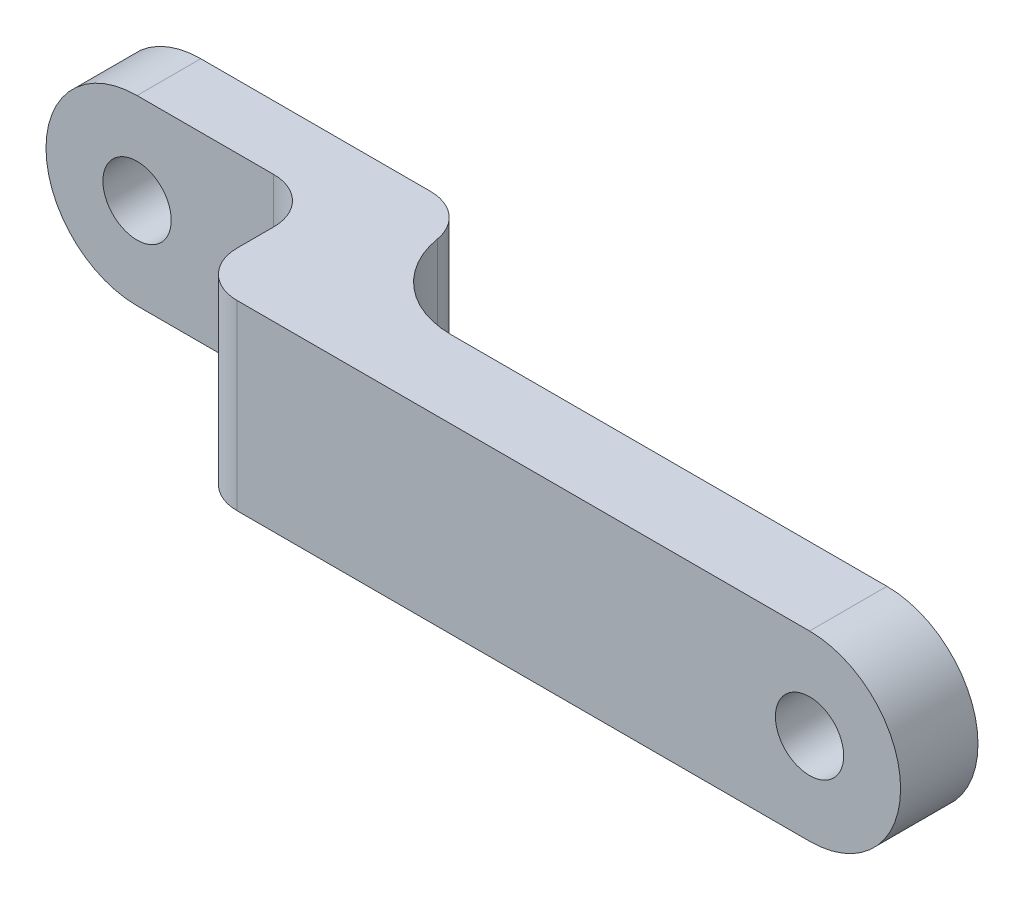
ISO-10303-21;
HEADER;
FILE_DESCRIPTION(('STEP AP214'),'2;1');
FILE_NAME('part.step','',(''),(''),'','','');
FILE_SCHEMA(('AUTOMOTIVE_DESIGN { 1 0 10303 214 1 1 1 1 }'));
ENDSEC;
DATA;
#1=APPLICATION_CONTEXT('core data for automotive mechanical design processes');
#2=APPLICATION_PROTOCOL_DEFINITION('international standard','automotive_design',2000,#1);
#3=PRODUCT_CONTEXT('',#1,'mechanical');
#4=PRODUCT('Part','Part','',(#3));
#5=PRODUCT_RELATED_PRODUCT_CATEGORY('part','',(#4));
#6=PRODUCT_DEFINITION_FORMATION('','',#4);
#7=PRODUCT_DEFINITION_CONTEXT('part definition',#1,'design');
#8=PRODUCT_DEFINITION('design','',#6,#7);
#9=PRODUCT_DEFINITION_SHAPE('','',#8);
#10=(LENGTH_UNIT() NAMED_UNIT(*) SI_UNIT(.MILLI.,.METRE.));
#11=(NAMED_UNIT(*) PLANE_ANGLE_UNIT() SI_UNIT($,.RADIAN.));
#12=(NAMED_UNIT(*) SI_UNIT($,.STERADIAN.) SOLID_ANGLE_UNIT());
#13=UNCERTAINTY_MEASURE_WITH_UNIT(LENGTH_MEASURE(1.E-05),#10,'distance_accuracy_value','');
#14=(GEOMETRIC_REPRESENTATION_CONTEXT(3) GLOBAL_UNCERTAINTY_ASSIGNED_CONTEXT((#13)) GLOBAL_UNIT_ASSIGNED_CONTEXT((#10,
#11,#12)) REPRESENTATION_CONTEXT('',''));
#15=CARTESIAN_POINT('',(0.,0.,0.));
#16=DIRECTION('',(0.,0.,1.));
#17=DIRECTION('',(1.,0.,0.));
#18=AXIS2_PLACEMENT_3D('',#15,#16,#17);
#19=CARTESIAN_POINT('',(0.,0.,0.85));
#20=DIRECTION('',(0.,0.,-1.));
#21=DIRECTION('',(-1.,0.,0.));
#22=AXIS2_PLACEMENT_3D('',#19,#20,#21);
#23=CYLINDRICAL_SURFACE('',#22,2.);
#24=CARTESIAN_POINT('',(0.,0.,-1.95));
#25=DIRECTION('',(0.,0.,1.));
#26=DIRECTION('',(1.,0.,0.));
#27=AXIS2_PLACEMENT_3D('',#24,#25,#26);
#28=CIRCLE('',#27,2.);
#29=CARTESIAN_POINT('',(0.,2.,-1.95));
#30=VERTEX_POINT('',#29);
#31=CARTESIAN_POINT('',(0.,-2.,-1.95));
#32=VERTEX_POINT('',#31);
#33=EDGE_CURVE('E117',#30,#32,#28,.T.);
#34=ORIENTED_EDGE('',*,*,#33,.F.);
#35=DIRECTION('',(0.,0.,-1.));
#36=VECTOR('',#35,1.);
#37=CARTESIAN_POINT('',(0.,2.,0.85));
#38=LINE('',#37,#36);
#39=CARTESIAN_POINT('',(0.,2.,-3.35));
#40=VERTEX_POINT('',#39);
#41=EDGE_CURVE('E250',#30,#40,#38,.T.);
#42=ORIENTED_EDGE('',*,*,#41,.T.);
#43=CARTESIAN_POINT('',(0.,0.,-3.35));
#44=DIRECTION('',(0.,0.,-1.));
#45=DIRECTION('',(-1.,0.,0.));
#46=AXIS2_PLACEMENT_3D('',#43,#44,#45);
#47=CIRCLE('',#46,2.);
#48=CARTESIAN_POINT('',(0.,-2.,-3.35));
#49=VERTEX_POINT('',#48);
#50=EDGE_CURVE('E140',#49,#40,#47,.T.);
#51=ORIENTED_EDGE('',*,*,#50,.F.);
#52=DIRECTION('',(0.,0.,-1.));
#53=VECTOR('',#52,1.);
#54=CARTESIAN_POINT('',(0.,-2.,0.85));
#55=LINE('',#54,#53);
#56=EDGE_CURVE('E134',#32,#49,#55,.T.);
#57=ORIENTED_EDGE('',*,*,#56,.F.);
#58=EDGE_LOOP('',(#34,#42,#51,#57));
#59=FACE_BOUND('',#58,.T.);
#60=ADVANCED_FACE('F34',(#59),#23,.T.);
#61=CARTESIAN_POINT('',(0.,0.,0.85));
#62=DIRECTION('',(0.,0.,-1.));
#63=DIRECTION('',(-1.,0.,0.));
#64=AXIS2_PLACEMENT_3D('',#61,#62,#63);
#65=CYLINDRICAL_SURFACE('',#64,0.75);
#66=CARTESIAN_POINT('',(0.,0.,-3.35));
#67=DIRECTION('',(0.,0.,-1.));
#68=DIRECTION('',(-1.,0.,0.));
#69=AXIS2_PLACEMENT_3D('',#66,#67,#68);
#70=CIRCLE('',#69,0.75);
#71=CARTESIAN_POINT('',(-0.75,0.,-3.35));
#72=VERTEX_POINT('',#71);
#73=EDGE_CURVE('E183',#72,#72,#70,.T.);
#74=ORIENTED_EDGE('',*,*,#73,.T.);
#75=EDGE_LOOP('',(#74));
#76=FACE_BOUND('',#75,.T.);
#77=CARTESIAN_POINT('',(0.,0.,-1.95));
#78=DIRECTION('',(0.,0.,1.));
#79=DIRECTION('',(1.,0.,0.));
#80=AXIS2_PLACEMENT_3D('',#77,#78,#79);
#81=CIRCLE('',#80,0.75);
#82=CARTESIAN_POINT('',(0.75,0.,-1.95));
#83=VERTEX_POINT('',#82);
#84=EDGE_CURVE('E128',#83,#83,#81,.T.);
#85=ORIENTED_EDGE('',*,*,#84,.T.);
#86=EDGE_LOOP('',(#85));
#87=FACE_BOUND('',#86,.T.);
#88=ADVANCED_FACE('F198',(#76,#87),#65,.F.);
#89=CARTESIAN_POINT('',(0.,0.,-0.85));
#90=DIRECTION('',(0.,0.,1.));
#91=DIRECTION('',(1.,0.,0.));
#92=AXIS2_PLACEMENT_3D('',#89,#90,#91);
#93=PLANE('',#92);
#94=CARTESIAN_POINT('',(17.57,0.,-0.85));
#95=DIRECTION('',(0.,0.,1.));
#96=DIRECTION('',(1.,0.,0.));
#97=AXIS2_PLACEMENT_3D('',#94,#95,#96);
#98=CIRCLE('',#97,0.750000000000002);
#99=CARTESIAN_POINT('',(18.32,0.,-0.85));
#100=VERTEX_POINT('',#99);
#101=EDGE_CURVE('E232',#100,#100,#98,.T.);
#102=ORIENTED_EDGE('',*,*,#101,.T.);
#103=EDGE_LOOP('',(#102));
#104=FACE_BOUND('',#103,.T.);
#105=DIRECTION('',(1.,0.,0.));
#106=VECTOR('',#105,1.);
#107=CARTESIAN_POINT('',(0.,-2.,-0.85));
#108=LINE('',#107,#106);
#109=CARTESIAN_POINT('',(8.,-2.,-0.85));
#110=VERTEX_POINT('',#109);
#111=CARTESIAN_POINT('',(17.57,-2.,-0.85));
#112=VERTEX_POINT('',#111);
#113=EDGE_CURVE('E240',#110,#112,#108,.T.);
#114=ORIENTED_EDGE('',*,*,#113,.F.);
#115=DIRECTION('',(0.,-1.,0.));
#116=VECTOR('',#115,1.);
#117=CARTESIAN_POINT('',(8.,2.,-0.85));
#118=LINE('',#117,#116);
#119=CARTESIAN_POINT('',(8.,2.,-0.85));
#120=VERTEX_POINT('',#119);
#121=EDGE_CURVE('E141',#110,#120,#118,.F.);
#122=ORIENTED_EDGE('',*,*,#121,.T.);
#123=DIRECTION('',(-1.,0.,0.));
#124=VECTOR('',#123,1.);
#125=CARTESIAN_POINT('',(0.,2.,-0.85));
#126=LINE('',#125,#124);
#127=CARTESIAN_POINT('',(17.57,2.,-0.85));
#128=VERTEX_POINT('',#127);
#129=EDGE_CURVE('E246',#128,#120,#126,.T.);
#130=ORIENTED_EDGE('',*,*,#129,.F.);
#131=CARTESIAN_POINT('',(17.57,0.,-0.85));
#132=DIRECTION('',(0.,0.,1.));
#133=DIRECTION('',(1.,0.,0.));
#134=AXIS2_PLACEMENT_3D('',#131,#132,#133);
#135=CIRCLE('',#134,2.);
#136=EDGE_CURVE('E252',#112,#128,#135,.T.);
#137=ORIENTED_EDGE('',*,*,#136,.F.);
#138=EDGE_LOOP('',(#114,#122,#130,#137));
#139=FACE_BOUND('',#138,.T.);
#140=ADVANCED_FACE('F203',(#104,#139),#93,.F.);
#141=CARTESIAN_POINT('',(0.,0.,0.85));
#142=DIRECTION('',(0.,0.,1.));
#143=DIRECTION('',(1.,0.,0.));
#144=AXIS2_PLACEMENT_3D('',#141,#142,#143);
#145=PLANE('',#144);
#146=DIRECTION('',(-1.,0.,0.));
#147=VECTOR('',#146,1.);
#148=CARTESIAN_POINT('',(0.,2.,0.85));
#149=LINE('',#148,#147);
#150=CARTESIAN_POINT('',(17.57,2.,0.85));
#151=VERTEX_POINT('',#150);
#152=CARTESIAN_POINT('',(5.,2.,0.85));
#153=VERTEX_POINT('',#152);
#154=EDGE_CURVE('E248',#151,#153,#149,.T.);
#155=ORIENTED_EDGE('',*,*,#154,.T.);
#156=DIRECTION('',(0.,1.,0.));
#157=VECTOR('',#156,1.);
#158=CARTESIAN_POINT('',(5.,-2.,0.85));
#159=LINE('',#158,#157);
#160=CARTESIAN_POINT('',(5.,-2.,0.85));
#161=VERTEX_POINT('',#160);
#162=EDGE_CURVE('E49',#153,#161,#159,.F.);
#163=ORIENTED_EDGE('',*,*,#162,.T.);
#164=DIRECTION('',(1.,0.,0.));
#165=VECTOR('',#164,1.);
#166=CARTESIAN_POINT('',(0.,-2.,0.85));
#167=LINE('',#166,#165);
#168=CARTESIAN_POINT('',(17.57,-2.,0.85));
#169=VERTEX_POINT('',#168);
#170=EDGE_CURVE('E243',#161,#169,#167,.T.);
#171=ORIENTED_EDGE('',*,*,#170,.T.);
#172=CARTESIAN_POINT('',(17.57,0.,0.85));
#173=DIRECTION('',(0.,0.,1.));
#174=DIRECTION('',(1.,0.,0.));
#175=AXIS2_PLACEMENT_3D('',#172,#173,#174);
#176=CIRCLE('',#175,2.);
#177=EDGE_CURVE('E245',#169,#151,#176,.T.);
#178=ORIENTED_EDGE('',*,*,#177,.T.);
#179=EDGE_LOOP('',(#155,#163,#171,#178));
#180=FACE_BOUND('',#179,.T.);
#181=CARTESIAN_POINT('',(17.57,0.,0.85));
#182=DIRECTION('',(0.,0.,1.));
#183=DIRECTION('',(1.,0.,0.));
#184=AXIS2_PLACEMENT_3D('',#181,#182,#183);
#185=CIRCLE('',#184,0.750000000000002);
#186=CARTESIAN_POINT('',(18.32,0.,0.85));
#187=VERTEX_POINT('',#186);
#188=EDGE_CURVE('E237',#187,#187,#185,.T.);
#189=ORIENTED_EDGE('',*,*,#188,.F.);
#190=EDGE_LOOP('',(#189));
#191=FACE_BOUND('',#190,.T.);
#192=ADVANCED_FACE('F264',(#180,#191),#145,.T.);
#193=CARTESIAN_POINT('',(0.,-2.,0.85));
#194=DIRECTION('',(0.,1.,0.));
#195=DIRECTION('',(0.,0.,1.));
#196=AXIS2_PLACEMENT_3D('',#193,#194,#195);
#197=PLANE('',#196);
#198=ORIENTED_EDGE('',*,*,#170,.F.);
#199=CARTESIAN_POINT('',(5.,-2.,-0.15));
#200=DIRECTION('',(0.,1.,0.));
#201=DIRECTION('',(0.,0.,1.));
#202=AXIS2_PLACEMENT_3D('',#199,#200,#201);
#203=CIRCLE('',#202,1.);
#204=CARTESIAN_POINT('',(4.,-2.,-0.15));
#205=VERTEX_POINT('',#204);
#206=EDGE_CURVE('E173',#161,#205,#203,.F.);
#207=ORIENTED_EDGE('',*,*,#206,.T.);
#208=DIRECTION('',(0.,0.,1.));
#209=VECTOR('',#208,1.);
#210=CARTESIAN_POINT('',(4.,-2.,-1.95));
#211=LINE('',#210,#209);
#212=CARTESIAN_POINT('',(4.,-2.,-0.95));
#213=VERTEX_POINT('',#212);
#214=EDGE_CURVE('E184',#213,#205,#211,.T.);
#215=ORIENTED_EDGE('',*,*,#214,.F.);
#216=CARTESIAN_POINT('',(3.,-2.,-0.95));
#217=DIRECTION('',(0.,1.,0.));
#218=DIRECTION('',(0.,0.,1.));
#219=AXIS2_PLACEMENT_3D('',#216,#217,#218);
#220=CIRCLE('',#219,1.);
#221=CARTESIAN_POINT('',(3.,-2.,-1.95));
#222=VERTEX_POINT('',#221);
#223=EDGE_CURVE('E11',#213,#222,#220,.T.);
#224=ORIENTED_EDGE('',*,*,#223,.T.);
#225=DIRECTION('',(1.,0.,0.));
#226=VECTOR('',#225,1.);
#227=CARTESIAN_POINT('',(0.,-2.,-1.95));
#228=LINE('',#227,#226);
#229=EDGE_CURVE('E121',#32,#222,#228,.T.);
#230=ORIENTED_EDGE('',*,*,#229,.F.);
#231=ORIENTED_EDGE('',*,*,#56,.T.);
#232=DIRECTION('',(-1.,0.,0.));
#233=VECTOR('',#232,1.);
#234=CARTESIAN_POINT('',(6.,-2.,-3.35));
#235=LINE('',#234,#233);
#236=CARTESIAN_POINT('',(5.04196010845019,-2.,-3.35));
#237=VERTEX_POINT('',#236);
#238=EDGE_CURVE('E230',#237,#49,#235,.T.);
#239=ORIENTED_EDGE('',*,*,#238,.F.);
#240=CARTESIAN_POINT('',(5.04196010845019,-2.,-2.35));
#241=DIRECTION('',(0.,1.,0.));
#242=DIRECTION('',(0.,0.,1.));
#243=AXIS2_PLACEMENT_3D('',#240,#241,#242);
#244=CIRCLE('',#243,1.);
#245=CARTESIAN_POINT('',(6.02797340563346,-2.,-2.51666666666667));
#246=VERTEX_POINT('',#245);
#247=EDGE_CURVE('E158',#237,#246,#244,.F.);
#248=ORIENTED_EDGE('',*,*,#247,.T.);
#249=CARTESIAN_POINT('',(8.,-2.,-2.85));
#250=DIRECTION('',(0.,1.,0.));
#251=DIRECTION('',(0.,0.,1.));
#252=AXIS2_PLACEMENT_3D('',#249,#250,#251);
#253=CIRCLE('',#252,2.);
#254=EDGE_CURVE('E144',#246,#110,#253,.T.);
#255=ORIENTED_EDGE('',*,*,#254,.T.);
#256=ORIENTED_EDGE('',*,*,#113,.T.);
#257=DIRECTION('',(0.,0.,-1.));
#258=VECTOR('',#257,1.);
#259=CARTESIAN_POINT('',(17.57,-2.,0.85));
#260=LINE('',#259,#258);
#261=EDGE_CURVE('E142',#169,#112,#260,.T.);
#262=ORIENTED_EDGE('',*,*,#261,.F.);
#263=EDGE_LOOP('',(#198,#207,#215,#224,#230,#231,#239,#248,#255,#256,#262));
#264=FACE_BOUND('',#263,.T.);
#265=ADVANCED_FACE('F132',(#264),#197,.F.);
#266=CARTESIAN_POINT('',(17.57,0.,0.85));
#267=DIRECTION('',(0.,0.,-1.));
#268=DIRECTION('',(-1.,0.,0.));
#269=AXIS2_PLACEMENT_3D('',#266,#267,#268);
#270=CYLINDRICAL_SURFACE('',#269,2.);
#271=ORIENTED_EDGE('',*,*,#136,.T.);
#272=DIRECTION('',(0.,0.,-1.));
#273=VECTOR('',#272,1.);
#274=CARTESIAN_POINT('',(17.57,2.,0.85));
#275=LINE('',#274,#273);
#276=EDGE_CURVE('E147',#151,#128,#275,.T.);
#277=ORIENTED_EDGE('',*,*,#276,.F.);
#278=ORIENTED_EDGE('',*,*,#177,.F.);
#279=ORIENTED_EDGE('',*,*,#261,.T.);
#280=EDGE_LOOP('',(#271,#277,#278,#279));
#281=FACE_BOUND('',#280,.T.);
#282=ADVANCED_FACE('F263',(#281),#270,.T.);
#283=CARTESIAN_POINT('',(0.,2.,0.85));
#284=DIRECTION('',(0.,-1.,0.));
#285=DIRECTION('',(0.,0.,-1.));
#286=AXIS2_PLACEMENT_3D('',#283,#284,#285);
#287=PLANE('',#286);
#288=DIRECTION('',(0.,0.,1.));
#289=VECTOR('',#288,1.);
#290=CARTESIAN_POINT('',(4.,2.,-1.95));
#291=LINE('',#290,#289);
#292=CARTESIAN_POINT('',(4.,2.,-0.95));
#293=VERTEX_POINT('',#292);
#294=CARTESIAN_POINT('',(4.,2.,-0.15));
#295=VERTEX_POINT('',#294);
#296=EDGE_CURVE('E176',#293,#295,#291,.T.);
#297=ORIENTED_EDGE('',*,*,#296,.T.);
#298=CARTESIAN_POINT('',(5.,2.,-0.15));
#299=DIRECTION('',(0.,-1.,0.));
#300=DIRECTION('',(0.,0.,-1.));
#301=AXIS2_PLACEMENT_3D('',#298,#299,#300);
#302=CIRCLE('',#301,1.);
#303=EDGE_CURVE('E57',#295,#153,#302,.F.);
#304=ORIENTED_EDGE('',*,*,#303,.T.);
#305=ORIENTED_EDGE('',*,*,#154,.F.);
#306=ORIENTED_EDGE('',*,*,#276,.T.);
#307=ORIENTED_EDGE('',*,*,#129,.T.);
#308=CARTESIAN_POINT('',(8.,2.,-2.85));
#309=DIRECTION('',(0.,-1.,0.));
#310=DIRECTION('',(0.,0.,-1.));
#311=AXIS2_PLACEMENT_3D('',#308,#309,#310);
#312=CIRCLE('',#311,2.);
#313=CARTESIAN_POINT('',(6.02797340563346,2.,-2.51666666666667));
#314=VERTEX_POINT('',#313);
#315=EDGE_CURVE('E152',#120,#314,#312,.T.);
#316=ORIENTED_EDGE('',*,*,#315,.T.);
#317=CARTESIAN_POINT('',(5.04196010845019,2.,-2.35));
#318=DIRECTION('',(0.,-1.,0.));
#319=DIRECTION('',(0.,0.,-1.));
#320=AXIS2_PLACEMENT_3D('',#317,#318,#319);
#321=CIRCLE('',#320,1.);
#322=CARTESIAN_POINT('',(5.04196010845019,2.,-3.35));
#323=VERTEX_POINT('',#322);
#324=EDGE_CURVE('E162',#314,#323,#321,.F.);
#325=ORIENTED_EDGE('',*,*,#324,.T.);
#326=DIRECTION('',(1.,0.,0.));
#327=VECTOR('',#326,1.);
#328=CARTESIAN_POINT('',(0.,2.,-3.35));
#329=LINE('',#328,#327);
#330=EDGE_CURVE('E225',#40,#323,#329,.T.);
#331=ORIENTED_EDGE('',*,*,#330,.F.);
#332=ORIENTED_EDGE('',*,*,#41,.F.);
#333=DIRECTION('',(-1.,0.,0.));
#334=VECTOR('',#333,1.);
#335=CARTESIAN_POINT('',(4.,2.,-1.95));
#336=LINE('',#335,#334);
#337=CARTESIAN_POINT('',(3.,2.,-1.95));
#338=VERTEX_POINT('',#337);
#339=EDGE_CURVE('E124',#338,#30,#336,.T.);
#340=ORIENTED_EDGE('',*,*,#339,.F.);
#341=CARTESIAN_POINT('',(3.,2.,-0.95));
#342=DIRECTION('',(0.,-1.,0.));
#343=DIRECTION('',(0.,0.,-1.));
#344=AXIS2_PLACEMENT_3D('',#341,#342,#343);
#345=CIRCLE('',#344,1.);
#346=EDGE_CURVE('E42',#338,#293,#345,.T.);
#347=ORIENTED_EDGE('',*,*,#346,.T.);
#348=EDGE_LOOP('',(#297,#304,#305,#306,#307,#316,#325,#331,#332,#340,#347));
#349=FACE_BOUND('',#348,.T.);
#350=ADVANCED_FACE('F175',(#349),#287,.F.);
#351=CARTESIAN_POINT('',(17.57,0.,0.85));
#352=DIRECTION('',(0.,0.,-1.));
#353=DIRECTION('',(-1.,0.,0.));
#354=AXIS2_PLACEMENT_3D('',#351,#352,#353);
#355=CYLINDRICAL_SURFACE('',#354,0.750000000000002);
#356=ORIENTED_EDGE('',*,*,#188,.T.);
#357=EDGE_LOOP('',(#356));
#358=FACE_BOUND('',#357,.T.);
#359=ORIENTED_EDGE('',*,*,#101,.F.);
#360=EDGE_LOOP('',(#359));
#361=FACE_BOUND('',#360,.T.);
#362=ADVANCED_FACE('F273',(#358,#361),#355,.F.);
#363=CARTESIAN_POINT('',(0.,0.,-3.35));
#364=DIRECTION('',(0.,0.,-1.));
#365=DIRECTION('',(-1.,0.,0.));
#366=AXIS2_PLACEMENT_3D('',#363,#364,#365);
#367=PLANE('',#366);
#368=ORIENTED_EDGE('',*,*,#330,.T.);
#369=DIRECTION('',(0.,-1.,0.));
#370=VECTOR('',#369,1.);
#371=CARTESIAN_POINT('',(5.04196010845019,-2.,-3.35));
#372=LINE('',#371,#370);
#373=EDGE_CURVE('E155',#323,#237,#372,.T.);
#374=ORIENTED_EDGE('',*,*,#373,.T.);
#375=ORIENTED_EDGE('',*,*,#238,.T.);
#376=ORIENTED_EDGE('',*,*,#50,.T.);
#377=EDGE_LOOP('',(#368,#374,#375,#376));
#378=FACE_BOUND('',#377,.T.);
#379=ORIENTED_EDGE('',*,*,#73,.F.);
#380=EDGE_LOOP('',(#379));
#381=FACE_BOUND('',#380,.T.);
#382=ADVANCED_FACE('F228',(#378,#381),#367,.T.);
#383=CARTESIAN_POINT('',(4.,2.,-1.95));
#384=DIRECTION('',(1.,0.,0.));
#385=DIRECTION('',(0.,0.,-1.));
#386=AXIS2_PLACEMENT_3D('',#383,#384,#385);
#387=PLANE('',#386);
#388=ORIENTED_EDGE('',*,*,#296,.F.);
#389=DIRECTION('',(0.,1.,0.));
#390=VECTOR('',#389,1.);
#391=CARTESIAN_POINT('',(4.,2.,-0.95));
#392=LINE('',#391,#390);
#393=EDGE_CURVE('E169',#293,#213,#392,.F.);
#394=ORIENTED_EDGE('',*,*,#393,.T.);
#395=ORIENTED_EDGE('',*,*,#214,.T.);
#396=DIRECTION('',(0.,1.,0.));
#397=VECTOR('',#396,1.);
#398=CARTESIAN_POINT('',(4.,2.,-0.15));
#399=LINE('',#398,#397);
#400=EDGE_CURVE('E166',#205,#295,#399,.T.);
#401=ORIENTED_EDGE('',*,*,#400,.T.);
#402=EDGE_LOOP('',(#388,#394,#395,#401));
#403=FACE_BOUND('',#402,.T.);
#404=ADVANCED_FACE('F180',(#403),#387,.F.);
#405=CARTESIAN_POINT('',(0.,0.,-1.95));
#406=DIRECTION('',(0.,0.,1.));
#407=DIRECTION('',(1.,0.,0.));
#408=AXIS2_PLACEMENT_3D('',#405,#406,#407);
#409=PLANE('',#408);
#410=ORIENTED_EDGE('',*,*,#84,.F.);
#411=EDGE_LOOP('',(#410));
#412=FACE_BOUND('',#411,.T.);
#413=ORIENTED_EDGE('',*,*,#229,.T.);
#414=DIRECTION('',(0.,1.,0.));
#415=VECTOR('',#414,1.);
#416=CARTESIAN_POINT('',(3.,0.,-1.95));
#417=LINE('',#416,#415);
#418=EDGE_CURVE('E164',#222,#338,#417,.T.);
#419=ORIENTED_EDGE('',*,*,#418,.T.);
#420=ORIENTED_EDGE('',*,*,#339,.T.);
#421=ORIENTED_EDGE('',*,*,#33,.T.);
#422=EDGE_LOOP('',(#413,#419,#420,#421));
#423=FACE_BOUND('',#422,.T.);
#424=ADVANCED_FACE('F119',(#412,#423),#409,.T.);
#425=CARTESIAN_POINT('',(8.,2.,-2.85));
#426=DIRECTION('',(0.,1.,0.));
#427=DIRECTION('',(0.,0.,1.));
#428=AXIS2_PLACEMENT_3D('',#425,#426,#427);
#429=CYLINDRICAL_SURFACE('',#428,2.);
#430=ORIENTED_EDGE('',*,*,#254,.F.);
#431=DIRECTION('',(0.,1.,0.));
#432=VECTOR('',#431,1.);
#433=CARTESIAN_POINT('',(6.02797340563346,2.,-2.51666666666667));
#434=LINE('',#433,#432);
#435=EDGE_CURVE('E160',#246,#314,#434,.T.);
#436=ORIENTED_EDGE('',*,*,#435,.T.);
#437=ORIENTED_EDGE('',*,*,#315,.F.);
#438=ORIENTED_EDGE('',*,*,#121,.F.);
#439=EDGE_LOOP('',(#430,#436,#437,#438));
#440=FACE_BOUND('',#439,.T.);
#441=ADVANCED_FACE('F194',(#440),#429,.F.);
#442=CARTESIAN_POINT('',(5.04196010845019,2.,-2.35));
#443=DIRECTION('',(0.,1.,0.));
#444=DIRECTION('',(0.,0.,1.));
#445=AXIS2_PLACEMENT_3D('',#442,#443,#444);
#446=CYLINDRICAL_SURFACE('',#445,1.);
#447=ORIENTED_EDGE('',*,*,#324,.F.);
#448=ORIENTED_EDGE('',*,*,#435,.F.);
#449=ORIENTED_EDGE('',*,*,#247,.F.);
#450=ORIENTED_EDGE('',*,*,#373,.F.);
#451=EDGE_LOOP('',(#447,#448,#449,#450));
#452=FACE_BOUND('',#451,.T.);
#453=ADVANCED_FACE('F188',(#452),#446,.T.);
#454=CARTESIAN_POINT('',(3.,0.,-0.95));
#455=DIRECTION('',(0.,1.,0.));
#456=DIRECTION('',(0.,0.,1.));
#457=AXIS2_PLACEMENT_3D('',#454,#455,#456);
#458=CYLINDRICAL_SURFACE('',#457,1.);
#459=ORIENTED_EDGE('',*,*,#223,.F.);
#460=ORIENTED_EDGE('',*,*,#393,.F.);
#461=ORIENTED_EDGE('',*,*,#346,.F.);
#462=ORIENTED_EDGE('',*,*,#418,.F.);
#463=EDGE_LOOP('',(#459,#460,#461,#462));
#464=FACE_BOUND('',#463,.T.);
#465=ADVANCED_FACE('F186',(#464),#458,.F.);
#466=CARTESIAN_POINT('',(5.,2.,-0.15));
#467=DIRECTION('',(0.,-1.,0.));
#468=DIRECTION('',(0.,0.,-1.));
#469=AXIS2_PLACEMENT_3D('',#466,#467,#468);
#470=CYLINDRICAL_SURFACE('',#469,1.);
#471=ORIENTED_EDGE('',*,*,#206,.F.);
#472=ORIENTED_EDGE('',*,*,#162,.F.);
#473=ORIENTED_EDGE('',*,*,#303,.F.);
#474=ORIENTED_EDGE('',*,*,#400,.F.);
#475=EDGE_LOOP('',(#471,#472,#473,#474));
#476=FACE_BOUND('',#475,.T.);
#477=ADVANCED_FACE('F36',(#476),#470,.T.);
#478=CLOSED_SHELL('',(#60,#88,#140,#192,#265,#282,#350,#362,#382,#404,#424,#441,#453,#465,#477));
#479=MANIFOLD_SOLID_BREP('B2',#478);
#480=ADVANCED_BREP_SHAPE_REPRESENTATION('',(#18,#479),#14);
#481=SHAPE_DEFINITION_REPRESENTATION(#9,#480);
ENDSEC;
END-ISO-10303-21;
